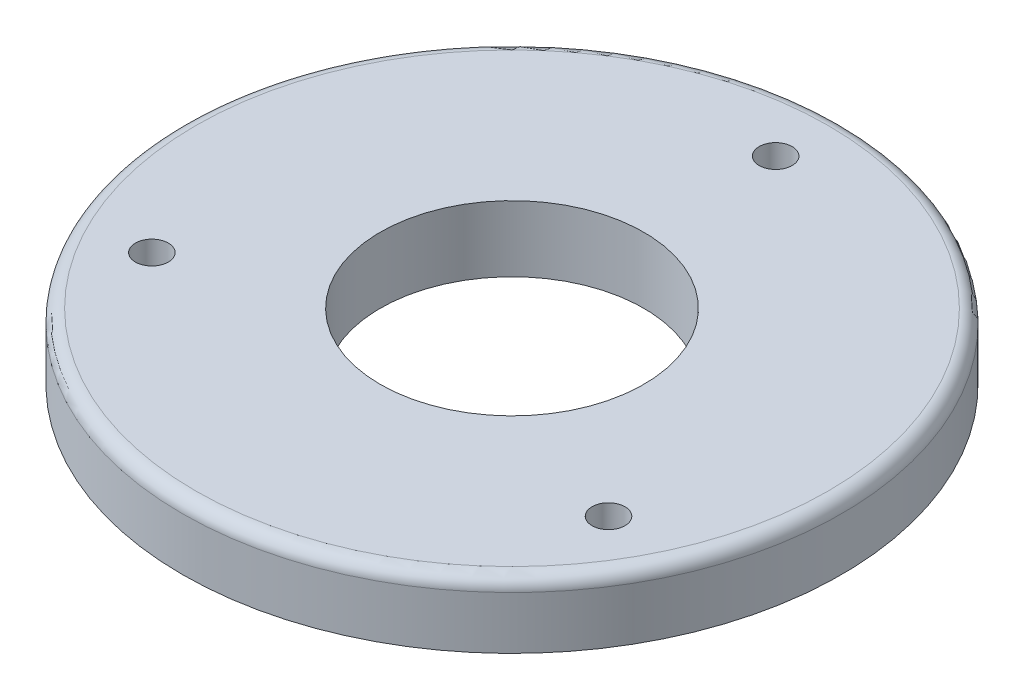
ISO-10303-21;
HEADER;
FILE_DESCRIPTION(('STEP AP214'),'2;1');
FILE_NAME('part.step','',(''),(''),'','','');
FILE_SCHEMA(('AUTOMOTIVE_DESIGN { 1 0 10303 214 1 1 1 1 }'));
ENDSEC;
DATA;
#1=APPLICATION_CONTEXT('core data for automotive mechanical design processes');
#2=APPLICATION_PROTOCOL_DEFINITION('international standard','automotive_design',2000,#1);
#3=PRODUCT_CONTEXT('',#1,'mechanical');
#4=PRODUCT('Part','Part','',(#3));
#5=PRODUCT_RELATED_PRODUCT_CATEGORY('part','',(#4));
#6=PRODUCT_DEFINITION_FORMATION('','',#4);
#7=PRODUCT_DEFINITION_CONTEXT('part definition',#1,'design');
#8=PRODUCT_DEFINITION('design','',#6,#7);
#9=PRODUCT_DEFINITION_SHAPE('','',#8);
#10=(LENGTH_UNIT() NAMED_UNIT(*) SI_UNIT(.MILLI.,.METRE.));
#11=(NAMED_UNIT(*) PLANE_ANGLE_UNIT() SI_UNIT($,.RADIAN.));
#12=(NAMED_UNIT(*) SI_UNIT($,.STERADIAN.) SOLID_ANGLE_UNIT());
#13=UNCERTAINTY_MEASURE_WITH_UNIT(LENGTH_MEASURE(1.E-05),#10,'distance_accuracy_value','');
#14=(GEOMETRIC_REPRESENTATION_CONTEXT(3) GLOBAL_UNCERTAINTY_ASSIGNED_CONTEXT((#13)) GLOBAL_UNIT_ASSIGNED_CONTEXT((#10,
#11,#12)) REPRESENTATION_CONTEXT('',''));
#15=CARTESIAN_POINT('',(0.,0.,0.));
#16=DIRECTION('',(0.,0.,1.));
#17=DIRECTION('',(1.,0.,0.));
#18=AXIS2_PLACEMENT_3D('',#15,#16,#17);
#19=CARTESIAN_POINT('',(0.,12.7,0.));
#20=DIRECTION('',(0.,-1.,0.));
#21=DIRECTION('',(0.,0.,-1.));
#22=AXIS2_PLACEMENT_3D('',#19,#20,#21);
#23=CYLINDRICAL_SURFACE('',#22,63.4999999999994);
#24=CARTESIAN_POINT('',(0.,10.16,0.));
#25=DIRECTION('',(0.,1.,0.));
#26=DIRECTION('',(0.,0.,1.));
#27=AXIS2_PLACEMENT_3D('',#24,#25,#26);
#28=CIRCLE('',#27,63.4999999999994);
#29=CARTESIAN_POINT('',(0.,10.16,63.4999999999994));
#30=VERTEX_POINT('',#29);
#31=EDGE_CURVE('E10',#30,#30,#28,.F.);
#32=ORIENTED_EDGE('',*,*,#31,.T.);
#33=EDGE_LOOP('',(#32));
#34=FACE_BOUND('',#33,.T.);
#35=CARTESIAN_POINT('',(0.,0.,0.));
#36=DIRECTION('',(0.,1.,0.));
#37=DIRECTION('',(0.,0.,1.));
#38=AXIS2_PLACEMENT_3D('',#35,#36,#37);
#39=CIRCLE('',#38,63.4999999999994);
#40=CARTESIAN_POINT('',(0.,0.,63.4999999999994));
#41=VERTEX_POINT('',#40);
#42=EDGE_CURVE('E46',#41,#41,#39,.T.);
#43=ORIENTED_EDGE('',*,*,#42,.T.);
#44=EDGE_LOOP('',(#43));
#45=FACE_BOUND('',#44,.T.);
#46=ADVANCED_FACE('F35',(#34,#45),#23,.T.);
#47=CARTESIAN_POINT('',(0.,12.7,0.));
#48=DIRECTION('',(0.,1.,0.));
#49=DIRECTION('',(0.,0.,1.));
#50=AXIS2_PLACEMENT_3D('',#47,#48,#49);
#51=PLANE('',#50);
#52=CARTESIAN_POINT('',(0.,12.7,0.));
#53=DIRECTION('',(0.,1.,0.));
#54=DIRECTION('',(0.,0.,1.));
#55=AXIS2_PLACEMENT_3D('',#52,#53,#54);
#56=CIRCLE('',#55,60.9599999999994);
#57=CARTESIAN_POINT('',(0.,12.7,60.9599999999994));
#58=VERTEX_POINT('',#57);
#59=EDGE_CURVE('E42',#58,#58,#56,.T.);
#60=ORIENTED_EDGE('',*,*,#59,.T.);
#61=EDGE_LOOP('',(#60));
#62=FACE_BOUND('',#61,.T.);
#63=CARTESIAN_POINT('',(0.,12.7,-50.8000000000006));
#64=DIRECTION('',(0.,1.,0.));
#65=DIRECTION('',(0.,0.,1.));
#66=AXIS2_PLACEMENT_3D('',#63,#64,#65);
#67=CIRCLE('',#66,3.17499999999984);
#68=CARTESIAN_POINT('',(0.,12.7,-47.6250000000008));
#69=VERTEX_POINT('',#68);
#70=EDGE_CURVE('E71',#69,#69,#67,.T.);
#71=ORIENTED_EDGE('',*,*,#70,.F.);
#72=EDGE_LOOP('',(#71));
#73=FACE_BOUND('',#72,.T.);
#74=CARTESIAN_POINT('',(43.9940905122498,12.7,25.4000000000003));
#75=DIRECTION('',(0.,1.,0.));
#76=DIRECTION('',(0.,0.,1.));
#77=AXIS2_PLACEMENT_3D('',#74,#75,#76);
#78=CIRCLE('',#77,3.17500000000018);
#79=CARTESIAN_POINT('',(43.9940905122498,12.7,28.5750000000005));
#80=VERTEX_POINT('',#79);
#81=EDGE_CURVE('E65',#80,#80,#78,.T.);
#82=ORIENTED_EDGE('',*,*,#81,.F.);
#83=EDGE_LOOP('',(#82));
#84=FACE_BOUND('',#83,.T.);
#85=CARTESIAN_POINT('',(-43.9940905122495,12.7,25.4));
#86=DIRECTION('',(0.,1.,0.));
#87=DIRECTION('',(0.,0.,1.));
#88=AXIS2_PLACEMENT_3D('',#85,#86,#87);
#89=CIRCLE('',#88,3.17499999999895);
#90=CARTESIAN_POINT('',(-43.9940905122495,12.7,28.574999999999));
#91=VERTEX_POINT('',#90);
#92=EDGE_CURVE('E59',#91,#91,#89,.T.);
#93=ORIENTED_EDGE('',*,*,#92,.F.);
#94=EDGE_LOOP('',(#93));
#95=FACE_BOUND('',#94,.T.);
#96=CARTESIAN_POINT('',(0.,12.7,0.));
#97=DIRECTION('',(0.,1.,0.));
#98=DIRECTION('',(0.,0.,1.));
#99=AXIS2_PLACEMENT_3D('',#96,#97,#98);
#100=CIRCLE('',#99,25.4);
#101=CARTESIAN_POINT('',(0.,12.7,25.4));
#102=VERTEX_POINT('',#101);
#103=EDGE_CURVE('E53',#102,#102,#100,.T.);
#104=ORIENTED_EDGE('',*,*,#103,.F.);
#105=EDGE_LOOP('',(#104));
#106=FACE_BOUND('',#105,.T.);
#107=ADVANCED_FACE('F87',(#62,#73,#84,#95,#106),#51,.T.);
#108=CARTESIAN_POINT('',(0.,0.,0.));
#109=DIRECTION('',(0.,1.,0.));
#110=DIRECTION('',(0.,0.,1.));
#111=AXIS2_PLACEMENT_3D('',#108,#109,#110);
#112=PLANE('',#111);
#113=CARTESIAN_POINT('',(0.,0.,-50.8000000000006));
#114=DIRECTION('',(0.,1.,0.));
#115=DIRECTION('',(0.,0.,1.));
#116=AXIS2_PLACEMENT_3D('',#113,#114,#115);
#117=CIRCLE('',#116,3.17499999999984);
#118=CARTESIAN_POINT('',(0.,0.,-47.6250000000008));
#119=VERTEX_POINT('',#118);
#120=EDGE_CURVE('E56',#119,#119,#117,.T.);
#121=ORIENTED_EDGE('',*,*,#120,.T.);
#122=EDGE_LOOP('',(#121));
#123=FACE_BOUND('',#122,.T.);
#124=CARTESIAN_POINT('',(43.9940905122498,0.,25.4000000000003));
#125=DIRECTION('',(0.,1.,0.));
#126=DIRECTION('',(0.,0.,1.));
#127=AXIS2_PLACEMENT_3D('',#124,#125,#126);
#128=CIRCLE('',#127,3.17500000000018);
#129=CARTESIAN_POINT('',(43.9940905122498,0.,28.5750000000005));
#130=VERTEX_POINT('',#129);
#131=EDGE_CURVE('E68',#130,#130,#128,.T.);
#132=ORIENTED_EDGE('',*,*,#131,.T.);
#133=EDGE_LOOP('',(#132));
#134=FACE_BOUND('',#133,.T.);
#135=CARTESIAN_POINT('',(-43.9940905122495,0.,25.4));
#136=DIRECTION('',(0.,1.,0.));
#137=DIRECTION('',(0.,0.,1.));
#138=AXIS2_PLACEMENT_3D('',#135,#136,#137);
#139=CIRCLE('',#138,3.17499999999895);
#140=CARTESIAN_POINT('',(-43.9940905122495,0.,28.574999999999));
#141=VERTEX_POINT('',#140);
#142=EDGE_CURVE('E62',#141,#141,#139,.T.);
#143=ORIENTED_EDGE('',*,*,#142,.T.);
#144=EDGE_LOOP('',(#143));
#145=FACE_BOUND('',#144,.T.);
#146=CARTESIAN_POINT('',(0.,0.,0.));
#147=DIRECTION('',(0.,1.,0.));
#148=DIRECTION('',(0.,0.,1.));
#149=AXIS2_PLACEMENT_3D('',#146,#147,#148);
#150=CIRCLE('',#149,25.4);
#151=CARTESIAN_POINT('',(0.,0.,25.4));
#152=VERTEX_POINT('',#151);
#153=EDGE_CURVE('E50',#152,#152,#150,.T.);
#154=ORIENTED_EDGE('',*,*,#153,.T.);
#155=EDGE_LOOP('',(#154));
#156=FACE_BOUND('',#155,.T.);
#157=ORIENTED_EDGE('',*,*,#42,.F.);
#158=EDGE_LOOP('',(#157));
#159=FACE_BOUND('',#158,.T.);
#160=ADVANCED_FACE('F77',(#123,#134,#145,#156,#159),#112,.F.);
#161=CARTESIAN_POINT('',(0.,0.,0.));
#162=DIRECTION('',(0.,1.,0.));
#163=DIRECTION('',(0.,0.,1.));
#164=AXIS2_PLACEMENT_3D('',#161,#162,#163);
#165=CYLINDRICAL_SURFACE('',#164,25.4);
#166=ORIENTED_EDGE('',*,*,#153,.F.);
#167=EDGE_LOOP('',(#166));
#168=FACE_BOUND('',#167,.T.);
#169=ORIENTED_EDGE('',*,*,#103,.T.);
#170=EDGE_LOOP('',(#169));
#171=FACE_BOUND('',#170,.T.);
#172=ADVANCED_FACE('F97',(#168,#171),#165,.F.);
#173=CARTESIAN_POINT('',(-43.9940905122495,0.,25.4));
#174=DIRECTION('',(0.,1.,0.));
#175=DIRECTION('',(0.,0.,1.));
#176=AXIS2_PLACEMENT_3D('',#173,#174,#175);
#177=CYLINDRICAL_SURFACE('',#176,3.17499999999895);
#178=ORIENTED_EDGE('',*,*,#142,.F.);
#179=EDGE_LOOP('',(#178));
#180=FACE_BOUND('',#179,.T.);
#181=ORIENTED_EDGE('',*,*,#92,.T.);
#182=EDGE_LOOP('',(#181));
#183=FACE_BOUND('',#182,.T.);
#184=ADVANCED_FACE('F99',(#180,#183),#177,.F.);
#185=CARTESIAN_POINT('',(43.9940905122498,0.,25.4000000000003));
#186=DIRECTION('',(0.,1.,0.));
#187=DIRECTION('',(0.,0.,1.));
#188=AXIS2_PLACEMENT_3D('',#185,#186,#187);
#189=CYLINDRICAL_SURFACE('',#188,3.17500000000018);
#190=ORIENTED_EDGE('',*,*,#131,.F.);
#191=EDGE_LOOP('',(#190));
#192=FACE_BOUND('',#191,.T.);
#193=ORIENTED_EDGE('',*,*,#81,.T.);
#194=EDGE_LOOP('',(#193));
#195=FACE_BOUND('',#194,.T.);
#196=ADVANCED_FACE('F83',(#192,#195),#189,.F.);
#197=CARTESIAN_POINT('',(0.,0.,-50.8000000000006));
#198=DIRECTION('',(0.,1.,0.));
#199=DIRECTION('',(0.,0.,1.));
#200=AXIS2_PLACEMENT_3D('',#197,#198,#199);
#201=CYLINDRICAL_SURFACE('',#200,3.17499999999984);
#202=ORIENTED_EDGE('',*,*,#120,.F.);
#203=EDGE_LOOP('',(#202));
#204=FACE_BOUND('',#203,.T.);
#205=ORIENTED_EDGE('',*,*,#70,.T.);
#206=EDGE_LOOP('',(#205));
#207=FACE_BOUND('',#206,.T.);
#208=ADVANCED_FACE('F80',(#204,#207),#201,.F.);
#209=CARTESIAN_POINT('',(0.,10.16,0.));
#210=DIRECTION('',(0.,1.,0.));
#211=DIRECTION('',(0.,0.,1.));
#212=AXIS2_PLACEMENT_3D('',#209,#210,#211);
#213=TOROIDAL_SURFACE('',#212,60.9599999999994,2.54);
#214=ORIENTED_EDGE('',*,*,#31,.F.);
#215=EDGE_LOOP('',(#214));
#216=FACE_BOUND('',#215,.T.);
#217=ORIENTED_EDGE('',*,*,#59,.F.);
#218=EDGE_LOOP('',(#217));
#219=FACE_BOUND('',#218,.T.);
#220=ADVANCED_FACE('F37',(#216,#219),#213,.T.);
#221=CLOSED_SHELL('',(#46,#107,#160,#172,#184,#196,#208,#220));
#222=MANIFOLD_SOLID_BREP('B2',#221);
#223=ADVANCED_BREP_SHAPE_REPRESENTATION('',(#18,#222),#14);
#224=SHAPE_DEFINITION_REPRESENTATION(#9,#223);
ENDSEC;
END-ISO-10303-21;
